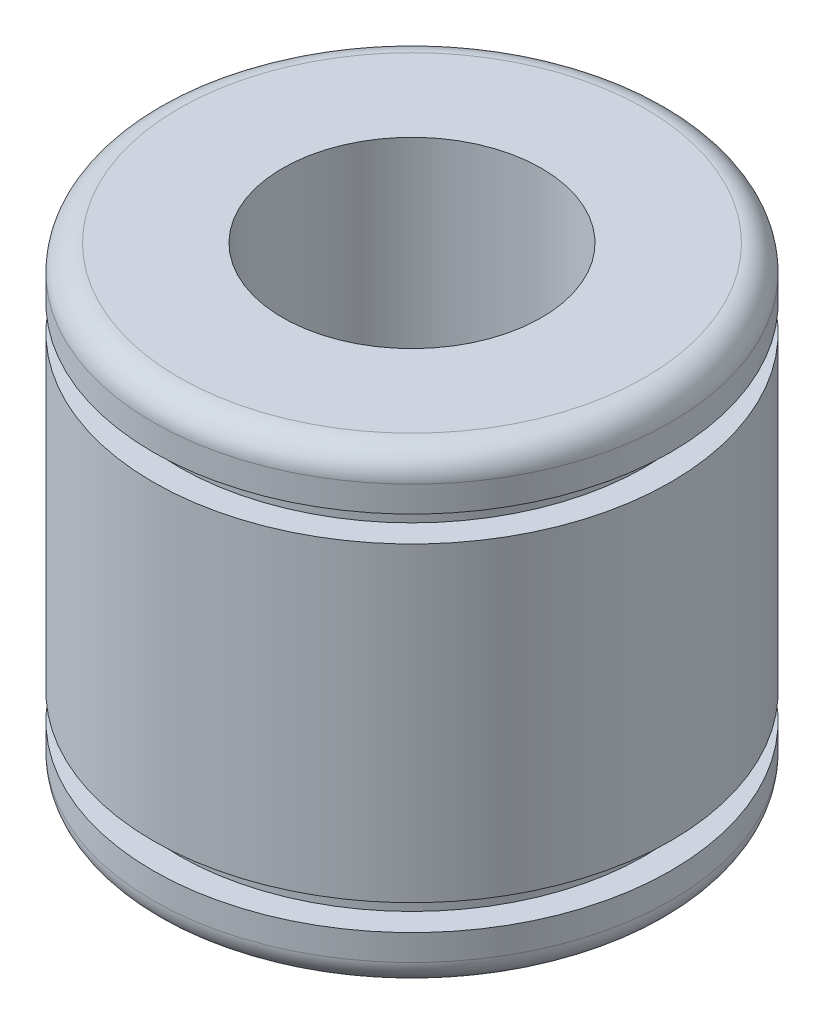
ISO-10303-21;
HEADER;
FILE_DESCRIPTION(('STEP AP214'),'2;1');
FILE_NAME('part.step','',(''),(''),'','','');
FILE_SCHEMA(('AUTOMOTIVE_DESIGN { 1 0 10303 214 1 1 1 1 }'));
ENDSEC;
DATA;
#1=APPLICATION_CONTEXT('core data for automotive mechanical design processes');
#2=APPLICATION_PROTOCOL_DEFINITION('international standard','automotive_design',2000,#1);
#3=PRODUCT_CONTEXT('',#1,'mechanical');
#4=PRODUCT('Part','Part','',(#3));
#5=PRODUCT_RELATED_PRODUCT_CATEGORY('part','',(#4));
#6=PRODUCT_DEFINITION_FORMATION('','',#4);
#7=PRODUCT_DEFINITION_CONTEXT('part definition',#1,'design');
#8=PRODUCT_DEFINITION('design','',#6,#7);
#9=PRODUCT_DEFINITION_SHAPE('','',#8);
#10=(LENGTH_UNIT() NAMED_UNIT(*) SI_UNIT(.MILLI.,.METRE.));
#11=(NAMED_UNIT(*) PLANE_ANGLE_UNIT() SI_UNIT($,.RADIAN.));
#12=(NAMED_UNIT(*) SI_UNIT($,.STERADIAN.) SOLID_ANGLE_UNIT());
#13=UNCERTAINTY_MEASURE_WITH_UNIT(LENGTH_MEASURE(1.E-05),#10,'distance_accuracy_value','');
#14=(GEOMETRIC_REPRESENTATION_CONTEXT(3) GLOBAL_UNCERTAINTY_ASSIGNED_CONTEXT((#13)) GLOBAL_UNIT_ASSIGNED_CONTEXT((#10,
#11,#12)) REPRESENTATION_CONTEXT('',''));
#15=CARTESIAN_POINT('',(0.,0.,0.));
#16=DIRECTION('',(0.,0.,1.));
#17=DIRECTION('',(1.,0.,0.));
#18=AXIS2_PLACEMENT_3D('',#15,#16,#17);
#19=CARTESIAN_POINT('',(0.,-18.8484126984127,0.));
#20=DIRECTION('',(0.,-1.,0.));
#21=DIRECTION('',(0.,0.,-1.));
#22=AXIS2_PLACEMENT_3D('',#19,#20,#21);
#23=CYLINDRICAL_SURFACE('',#22,2.5);
#24=CARTESIAN_POINT('',(0.,-4.5,0.));
#25=DIRECTION('',(0.,-1.,0.));
#26=DIRECTION('',(0.,0.,-1.));
#27=AXIS2_PLACEMENT_3D('',#24,#25,#26);
#28=CIRCLE('',#27,2.5);
#29=CARTESIAN_POINT('',(0.,-4.5,-2.5));
#30=VERTEX_POINT('',#29);
#31=EDGE_CURVE('E70',#30,#30,#28,.T.);
#32=ORIENTED_EDGE('',*,*,#31,.T.);
#33=EDGE_LOOP('',(#32));
#34=FACE_BOUND('',#33,.T.);
#35=CARTESIAN_POINT('',(0.,4.5,0.));
#36=DIRECTION('',(0.,-1.,0.));
#37=DIRECTION('',(0.,0.,-1.));
#38=AXIS2_PLACEMENT_3D('',#35,#36,#37);
#39=CIRCLE('',#38,2.5);
#40=CARTESIAN_POINT('',(0.,4.5,-2.5));
#41=VERTEX_POINT('',#40);
#42=EDGE_CURVE('E10',#41,#41,#39,.T.);
#43=ORIENTED_EDGE('',*,*,#42,.F.);
#44=EDGE_LOOP('',(#43));
#45=FACE_BOUND('',#44,.T.);
#46=ADVANCED_FACE('F24',(#34,#45),#23,.F.);
#47=CARTESIAN_POINT('',(2.5,4.5,0.));
#48=DIRECTION('',(0.,1.,0.));
#49=DIRECTION('',(0.,0.,1.));
#50=AXIS2_PLACEMENT_3D('',#47,#48,#49);
#51=PLANE('',#50);
#52=ORIENTED_EDGE('',*,*,#42,.T.);
#53=EDGE_LOOP('',(#52));
#54=FACE_BOUND('',#53,.T.);
#55=CARTESIAN_POINT('',(0.,4.5,0.));
#56=DIRECTION('',(0.,-1.,0.));
#57=DIRECTION('',(0.,0.,-1.));
#58=AXIS2_PLACEMENT_3D('',#55,#56,#57);
#59=CIRCLE('',#58,4.5);
#60=CARTESIAN_POINT('',(0.,4.5,-4.5));
#61=VERTEX_POINT('',#60);
#62=EDGE_CURVE('E30',#61,#61,#59,.T.);
#63=ORIENTED_EDGE('',*,*,#62,.F.);
#64=EDGE_LOOP('',(#63));
#65=FACE_BOUND('',#64,.T.);
#66=ADVANCED_FACE('F88',(#54,#65),#51,.T.);
#67=CARTESIAN_POINT('',(0.,4.,0.));
#68=DIRECTION('',(0.,-1.,0.));
#69=DIRECTION('',(0.,0.,-1.));
#70=AXIS2_PLACEMENT_3D('',#67,#68,#69);
#71=TOROIDAL_SURFACE('',#70,4.5,0.5);
#72=ORIENTED_EDGE('',*,*,#62,.T.);
#73=EDGE_LOOP('',(#72));
#74=FACE_BOUND('',#73,.T.);
#75=CARTESIAN_POINT('',(0.,4.,0.));
#76=DIRECTION('',(0.,-1.,0.));
#77=DIRECTION('',(0.,0.,-1.));
#78=AXIS2_PLACEMENT_3D('',#75,#76,#77);
#79=CIRCLE('',#78,4.99999999999999);
#80=CARTESIAN_POINT('',(0.,4.,-5.));
#81=VERTEX_POINT('',#80);
#82=EDGE_CURVE('E34',#81,#81,#79,.T.);
#83=ORIENTED_EDGE('',*,*,#82,.F.);
#84=EDGE_LOOP('',(#83));
#85=FACE_BOUND('',#84,.T.);
#86=ADVANCED_FACE('F92',(#74,#85),#71,.T.);
#87=CARTESIAN_POINT('',(0.,-18.8484126984127,0.));
#88=DIRECTION('',(0.,-1.,0.));
#89=DIRECTION('',(0.,0.,-1.));
#90=AXIS2_PLACEMENT_3D('',#87,#88,#89);
#91=CYLINDRICAL_SURFACE('',#90,4.99999999999999);
#92=ORIENTED_EDGE('',*,*,#82,.T.);
#93=EDGE_LOOP('',(#92));
#94=FACE_BOUND('',#93,.T.);
#95=CARTESIAN_POINT('',(0.,3.5,0.));
#96=DIRECTION('',(0.,-1.,0.));
#97=DIRECTION('',(0.,0.,-1.));
#98=AXIS2_PLACEMENT_3D('',#95,#96,#97);
#99=CIRCLE('',#98,4.99999999999999);
#100=CARTESIAN_POINT('',(0.,3.5,-5.));
#101=VERTEX_POINT('',#100);
#102=EDGE_CURVE('E38',#101,#101,#99,.T.);
#103=ORIENTED_EDGE('',*,*,#102,.F.);
#104=EDGE_LOOP('',(#103));
#105=FACE_BOUND('',#104,.T.);
#106=ADVANCED_FACE('F96',(#94,#105),#91,.T.);
#107=CARTESIAN_POINT('',(4.5,3.5,0.));
#108=DIRECTION('',(0.,-1.,0.));
#109=DIRECTION('',(0.,0.,-1.));
#110=AXIS2_PLACEMENT_3D('',#107,#108,#109);
#111=PLANE('',#110);
#112=ORIENTED_EDGE('',*,*,#102,.T.);
#113=EDGE_LOOP('',(#112));
#114=FACE_BOUND('',#113,.T.);
#115=CARTESIAN_POINT('',(0.,3.5,0.));
#116=DIRECTION('',(0.,-1.,0.));
#117=DIRECTION('',(0.,0.,-1.));
#118=AXIS2_PLACEMENT_3D('',#115,#116,#117);
#119=CIRCLE('',#118,4.49999999999999);
#120=CARTESIAN_POINT('',(0.,3.5,-4.5));
#121=VERTEX_POINT('',#120);
#122=EDGE_CURVE('E43',#121,#121,#119,.T.);
#123=ORIENTED_EDGE('',*,*,#122,.F.);
#124=EDGE_LOOP('',(#123));
#125=FACE_BOUND('',#124,.T.);
#126=ADVANCED_FACE('F102',(#114,#125),#111,.T.);
#127=CARTESIAN_POINT('',(0.,-18.8484126984127,0.));
#128=DIRECTION('',(0.,-1.,0.));
#129=DIRECTION('',(0.,0.,-1.));
#130=AXIS2_PLACEMENT_3D('',#127,#128,#129);
#131=CYLINDRICAL_SURFACE('',#130,4.49999999999999);
#132=ORIENTED_EDGE('',*,*,#122,.T.);
#133=EDGE_LOOP('',(#132));
#134=FACE_BOUND('',#133,.T.);
#135=CARTESIAN_POINT('',(0.,3.,0.));
#136=DIRECTION('',(0.,-1.,0.));
#137=DIRECTION('',(0.,0.,-1.));
#138=AXIS2_PLACEMENT_3D('',#135,#136,#137);
#139=CIRCLE('',#138,4.49999999999999);
#140=CARTESIAN_POINT('',(0.,3.,-4.5));
#141=VERTEX_POINT('',#140);
#142=EDGE_CURVE('E46',#141,#141,#139,.T.);
#143=ORIENTED_EDGE('',*,*,#142,.F.);
#144=EDGE_LOOP('',(#143));
#145=FACE_BOUND('',#144,.T.);
#146=ADVANCED_FACE('F106',(#134,#145),#131,.T.);
#147=CARTESIAN_POINT('',(4.5,3.,0.));
#148=DIRECTION('',(0.,1.,0.));
#149=DIRECTION('',(0.,0.,1.));
#150=AXIS2_PLACEMENT_3D('',#147,#148,#149);
#151=PLANE('',#150);
#152=ORIENTED_EDGE('',*,*,#142,.T.);
#153=EDGE_LOOP('',(#152));
#154=FACE_BOUND('',#153,.T.);
#155=CARTESIAN_POINT('',(0.,3.,0.));
#156=DIRECTION('',(0.,-1.,0.));
#157=DIRECTION('',(0.,0.,-1.));
#158=AXIS2_PLACEMENT_3D('',#155,#156,#157);
#159=CIRCLE('',#158,4.99999999999999);
#160=CARTESIAN_POINT('',(0.,3.,-5.));
#161=VERTEX_POINT('',#160);
#162=EDGE_CURVE('E49',#161,#161,#159,.T.);
#163=ORIENTED_EDGE('',*,*,#162,.F.);
#164=EDGE_LOOP('',(#163));
#165=FACE_BOUND('',#164,.T.);
#166=ADVANCED_FACE('F110',(#154,#165),#151,.T.);
#167=CARTESIAN_POINT('',(0.,-18.8484126984127,0.));
#168=DIRECTION('',(0.,-1.,0.));
#169=DIRECTION('',(0.,0.,-1.));
#170=AXIS2_PLACEMENT_3D('',#167,#168,#169);
#171=CYLINDRICAL_SURFACE('',#170,4.99999999999999);
#172=ORIENTED_EDGE('',*,*,#162,.T.);
#173=EDGE_LOOP('',(#172));
#174=FACE_BOUND('',#173,.T.);
#175=CARTESIAN_POINT('',(0.,-3.,0.));
#176=DIRECTION('',(0.,-1.,0.));
#177=DIRECTION('',(0.,0.,-1.));
#178=AXIS2_PLACEMENT_3D('',#175,#176,#177);
#179=CIRCLE('',#178,4.99999999999999);
#180=CARTESIAN_POINT('',(0.,-3.,-5.));
#181=VERTEX_POINT('',#180);
#182=EDGE_CURVE('E52',#181,#181,#179,.T.);
#183=ORIENTED_EDGE('',*,*,#182,.F.);
#184=EDGE_LOOP('',(#183));
#185=FACE_BOUND('',#184,.T.);
#186=ADVANCED_FACE('F114',(#174,#185),#171,.T.);
#187=CARTESIAN_POINT('',(4.5,-3.,0.));
#188=DIRECTION('',(0.,-1.,0.));
#189=DIRECTION('',(0.,0.,-1.));
#190=AXIS2_PLACEMENT_3D('',#187,#188,#189);
#191=PLANE('',#190);
#192=ORIENTED_EDGE('',*,*,#182,.T.);
#193=EDGE_LOOP('',(#192));
#194=FACE_BOUND('',#193,.T.);
#195=CARTESIAN_POINT('',(0.,-3.,0.));
#196=DIRECTION('',(0.,-1.,0.));
#197=DIRECTION('',(0.,0.,-1.));
#198=AXIS2_PLACEMENT_3D('',#195,#196,#197);
#199=CIRCLE('',#198,4.49999999999999);
#200=CARTESIAN_POINT('',(0.,-3.,-4.5));
#201=VERTEX_POINT('',#200);
#202=EDGE_CURVE('E55',#201,#201,#199,.T.);
#203=ORIENTED_EDGE('',*,*,#202,.F.);
#204=EDGE_LOOP('',(#203));
#205=FACE_BOUND('',#204,.T.);
#206=ADVANCED_FACE('F118',(#194,#205),#191,.T.);
#207=CARTESIAN_POINT('',(0.,-18.8484126984127,0.));
#208=DIRECTION('',(0.,-1.,0.));
#209=DIRECTION('',(0.,0.,-1.));
#210=AXIS2_PLACEMENT_3D('',#207,#208,#209);
#211=CYLINDRICAL_SURFACE('',#210,4.49999999999999);
#212=ORIENTED_EDGE('',*,*,#202,.T.);
#213=EDGE_LOOP('',(#212));
#214=FACE_BOUND('',#213,.T.);
#215=CARTESIAN_POINT('',(0.,-3.5,0.));
#216=DIRECTION('',(0.,-1.,0.));
#217=DIRECTION('',(0.,0.,-1.));
#218=AXIS2_PLACEMENT_3D('',#215,#216,#217);
#219=CIRCLE('',#218,4.49999999999999);
#220=CARTESIAN_POINT('',(0.,-3.5,-4.5));
#221=VERTEX_POINT('',#220);
#222=EDGE_CURVE('E58',#221,#221,#219,.T.);
#223=ORIENTED_EDGE('',*,*,#222,.F.);
#224=EDGE_LOOP('',(#223));
#225=FACE_BOUND('',#224,.T.);
#226=ADVANCED_FACE('F122',(#214,#225),#211,.T.);
#227=CARTESIAN_POINT('',(4.5,-3.5,0.));
#228=DIRECTION('',(0.,1.,0.));
#229=DIRECTION('',(0.,0.,1.));
#230=AXIS2_PLACEMENT_3D('',#227,#228,#229);
#231=PLANE('',#230);
#232=ORIENTED_EDGE('',*,*,#222,.T.);
#233=EDGE_LOOP('',(#232));
#234=FACE_BOUND('',#233,.T.);
#235=CARTESIAN_POINT('',(0.,-3.5,0.));
#236=DIRECTION('',(0.,-1.,0.));
#237=DIRECTION('',(0.,0.,-1.));
#238=AXIS2_PLACEMENT_3D('',#235,#236,#237);
#239=CIRCLE('',#238,4.99999999999999);
#240=CARTESIAN_POINT('',(0.,-3.5,-5.));
#241=VERTEX_POINT('',#240);
#242=EDGE_CURVE('E61',#241,#241,#239,.T.);
#243=ORIENTED_EDGE('',*,*,#242,.F.);
#244=EDGE_LOOP('',(#243));
#245=FACE_BOUND('',#244,.T.);
#246=ADVANCED_FACE('F126',(#234,#245),#231,.T.);
#247=CARTESIAN_POINT('',(0.,-18.8484126984127,0.));
#248=DIRECTION('',(0.,-1.,0.));
#249=DIRECTION('',(0.,0.,-1.));
#250=AXIS2_PLACEMENT_3D('',#247,#248,#249);
#251=CYLINDRICAL_SURFACE('',#250,4.99999999999999);
#252=ORIENTED_EDGE('',*,*,#242,.T.);
#253=EDGE_LOOP('',(#252));
#254=FACE_BOUND('',#253,.T.);
#255=CARTESIAN_POINT('',(0.,-4.,0.));
#256=DIRECTION('',(0.,-1.,0.));
#257=DIRECTION('',(0.,0.,-1.));
#258=AXIS2_PLACEMENT_3D('',#255,#256,#257);
#259=CIRCLE('',#258,4.99999999999999);
#260=CARTESIAN_POINT('',(0.,-4.,-5.));
#261=VERTEX_POINT('',#260);
#262=EDGE_CURVE('E64',#261,#261,#259,.T.);
#263=ORIENTED_EDGE('',*,*,#262,.F.);
#264=EDGE_LOOP('',(#263));
#265=FACE_BOUND('',#264,.T.);
#266=ADVANCED_FACE('F84',(#254,#265),#251,.T.);
#267=CARTESIAN_POINT('',(0.,-4.,0.));
#268=DIRECTION('',(0.,-1.,0.));
#269=DIRECTION('',(0.,0.,-1.));
#270=AXIS2_PLACEMENT_3D('',#267,#268,#269);
#271=TOROIDAL_SURFACE('',#270,4.5,0.5);
#272=ORIENTED_EDGE('',*,*,#262,.T.);
#273=EDGE_LOOP('',(#272));
#274=FACE_BOUND('',#273,.T.);
#275=CARTESIAN_POINT('',(0.,-4.5,0.));
#276=DIRECTION('',(0.,-1.,0.));
#277=DIRECTION('',(0.,0.,-1.));
#278=AXIS2_PLACEMENT_3D('',#275,#276,#277);
#279=CIRCLE('',#278,4.5);
#280=CARTESIAN_POINT('',(0.,-4.5,-4.5));
#281=VERTEX_POINT('',#280);
#282=EDGE_CURVE('E67',#281,#281,#279,.T.);
#283=ORIENTED_EDGE('',*,*,#282,.F.);
#284=EDGE_LOOP('',(#283));
#285=FACE_BOUND('',#284,.T.);
#286=ADVANCED_FACE('F78',(#274,#285),#271,.T.);
#287=CARTESIAN_POINT('',(2.5,-4.5,0.));
#288=DIRECTION('',(0.,-1.,0.));
#289=DIRECTION('',(0.,0.,-1.));
#290=AXIS2_PLACEMENT_3D('',#287,#288,#289);
#291=PLANE('',#290);
#292=ORIENTED_EDGE('',*,*,#282,.T.);
#293=EDGE_LOOP('',(#292));
#294=FACE_BOUND('',#293,.T.);
#295=ORIENTED_EDGE('',*,*,#31,.F.);
#296=EDGE_LOOP('',(#295));
#297=FACE_BOUND('',#296,.T.);
#298=ADVANCED_FACE('F76',(#294,#297),#291,.T.);
#299=CLOSED_SHELL('',(#46,#66,#86,#106,#126,#146,#166,#186,#206,#226,#246,#266,#286,#298));
#300=MANIFOLD_SOLID_BREP('B2',#299);
#301=ADVANCED_BREP_SHAPE_REPRESENTATION('',(#18,#300),#14);
#302=SHAPE_DEFINITION_REPRESENTATION(#9,#301);
ENDSEC;
END-ISO-10303-21;
